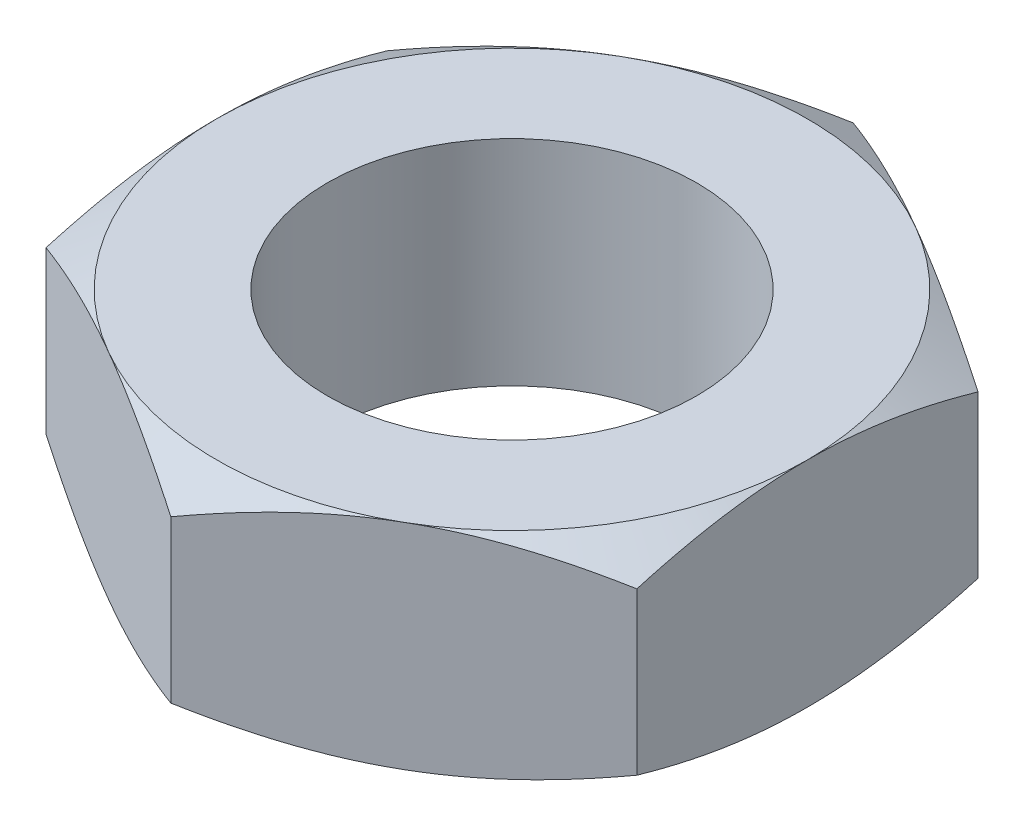
ISO-10303-21;
HEADER;
FILE_DESCRIPTION(('STEP AP214'),'2;1');
FILE_NAME('part.step','',(''),(''),'','','');
FILE_SCHEMA(('AUTOMOTIVE_DESIGN { 1 0 10303 214 1 1 1 1 }'));
ENDSEC;
DATA;
#1=APPLICATION_CONTEXT('core data for automotive mechanical design processes');
#2=APPLICATION_PROTOCOL_DEFINITION('international standard','automotive_design',2000,#1);
#3=PRODUCT_CONTEXT('',#1,'mechanical');
#4=PRODUCT('Part','Part','',(#3));
#5=PRODUCT_RELATED_PRODUCT_CATEGORY('part','',(#4));
#6=PRODUCT_DEFINITION_FORMATION('','',#4);
#7=PRODUCT_DEFINITION_CONTEXT('part definition',#1,'design');
#8=PRODUCT_DEFINITION('design','',#6,#7);
#9=PRODUCT_DEFINITION_SHAPE('','',#8);
#10=(LENGTH_UNIT() NAMED_UNIT(*) SI_UNIT(.MILLI.,.METRE.));
#11=(NAMED_UNIT(*) PLANE_ANGLE_UNIT() SI_UNIT($,.RADIAN.));
#12=(NAMED_UNIT(*) SI_UNIT($,.STERADIAN.) SOLID_ANGLE_UNIT());
#13=UNCERTAINTY_MEASURE_WITH_UNIT(LENGTH_MEASURE(1.E-05),#10,'distance_accuracy_value','');
#14=(GEOMETRIC_REPRESENTATION_CONTEXT(3) GLOBAL_UNCERTAINTY_ASSIGNED_CONTEXT((#13)) GLOBAL_UNIT_ASSIGNED_CONTEXT((#10,
#11,#12)) REPRESENTATION_CONTEXT('',''));
#15=CARTESIAN_POINT('',(0.,0.,0.));
#16=DIRECTION('',(0.,0.,1.));
#17=DIRECTION('',(1.,0.,0.));
#18=AXIS2_PLACEMENT_3D('',#15,#16,#17);
#19=CARTESIAN_POINT('',(-4.,1.45,-2.30940107675852));
#20=DIRECTION('',(0.,1.,0.));
#21=DIRECTION('',(0.,0.,1.));
#22=AXIS2_PLACEMENT_3D('',#19,#20,#21);
#23=PLANE('',#22);
#24=CARTESIAN_POINT('',(0.,1.45,0.));
#25=DIRECTION('',(0.,1.,0.));
#26=DIRECTION('',(0.,0.,1.));
#27=AXIS2_PLACEMENT_3D('',#24,#25,#26);
#28=CIRCLE('',#27,2.5);
#29=CARTESIAN_POINT('',(0.,1.45,2.5));
#30=VERTEX_POINT('',#29);
#31=EDGE_CURVE('E259',#30,#30,#28,.T.);
#32=ORIENTED_EDGE('',*,*,#31,.F.);
#33=EDGE_LOOP('',(#32));
#34=FACE_BOUND('',#33,.T.);
#35=CARTESIAN_POINT('',(0.,1.45,0.));
#36=DIRECTION('',(0.,1.,0.));
#37=DIRECTION('',(0.,0.,1.));
#38=AXIS2_PLACEMENT_3D('',#35,#36,#37);
#39=CIRCLE('',#38,4.);
#40=CARTESIAN_POINT('',(-1.99999999999999,1.45,3.46410161513774));
#41=VERTEX_POINT('',#40);
#42=CARTESIAN_POINT('',(1.99999999999999,1.45,3.46410161513774));
#43=VERTEX_POINT('',#42);
#44=EDGE_CURVE('E328',#41,#43,#39,.T.);
#45=ORIENTED_EDGE('',*,*,#44,.T.);
#46=CARTESIAN_POINT('',(4.,1.45,0.));
#47=VERTEX_POINT('',#46);
#48=EDGE_CURVE('E332',#43,#47,#39,.T.);
#49=ORIENTED_EDGE('',*,*,#48,.T.);
#50=CARTESIAN_POINT('',(2.00000000000001,1.45,-3.46410161513777));
#51=VERTEX_POINT('',#50);
#52=EDGE_CURVE('E341',#47,#51,#39,.T.);
#53=ORIENTED_EDGE('',*,*,#52,.T.);
#54=CARTESIAN_POINT('',(-2.00000000000001,1.45,-3.46410161513777));
#55=VERTEX_POINT('',#54);
#56=EDGE_CURVE('E347',#51,#55,#39,.T.);
#57=ORIENTED_EDGE('',*,*,#56,.T.);
#58=CARTESIAN_POINT('',(-4.,1.45,0.));
#59=VERTEX_POINT('',#58);
#60=EDGE_CURVE('E337',#55,#59,#39,.T.);
#61=ORIENTED_EDGE('',*,*,#60,.T.);
#62=EDGE_CURVE('E331',#59,#41,#39,.T.);
#63=ORIENTED_EDGE('',*,*,#62,.T.);
#64=EDGE_LOOP('',(#45,#49,#53,#57,#61,#63));
#65=FACE_BOUND('',#64,.T.);
#66=ADVANCED_FACE('F41',(#34,#65),#23,.T.);
#67=CARTESIAN_POINT('',(0.,1.45,-4.61880215351703));
#68=DIRECTION('',(0.5,0.,0.866025403784438));
#69=DIRECTION('',(0.866025403784438,0.,-0.5));
#70=AXIS2_PLACEMENT_3D('',#67,#68,#69);
#71=PLANE('',#70);
#72=DIRECTION('',(0.,-1.,0.));
#73=VECTOR('',#72,1.);
#74=CARTESIAN_POINT('',(0.,1.45,-4.61880215351703));
#75=LINE('',#74,#73);
#76=CARTESIAN_POINT('',(0.,1.09273441009183,-4.61880215351703));
#77=VERTEX_POINT('',#76);
#78=CARTESIAN_POINT('',(0.,-1.09273441009183,-4.61880215351703));
#79=VERTEX_POINT('',#78);
#80=EDGE_CURVE('E255',#77,#79,#75,.T.);
#81=ORIENTED_EDGE('',*,*,#80,.T.);
#82=CARTESIAN_POINT('',(0.000200000000003521,-1.09266774092522,-4.61891762357087));
#83=CARTESIAN_POINT('',(-0.175579150323225,-1.15128212635171,-4.51743148381383));
#84=CARTESIAN_POINT('',(-0.352875616326379,-1.20458967853773,-4.41506932144054));
#85=CARTESIAN_POINT('',(-0.710538593175707,-1.29763832925359,-4.20857250547742));
#86=CARTESIAN_POINT('',(-0.890911458970152,-1.33734651097029,-4.10443418285649));
#87=CARTESIAN_POINT('',(-1.24942181870279,-1.39915778471971,-3.89744813015758));
#88=CARTESIAN_POINT('',(-1.42750415293515,-1.4216722684771,-3.79463224655061));
#89=CARTESIAN_POINT('',(-1.78450671716651,-1.44854937685341,-3.58851671999025));
#90=CARTESIAN_POINT('',(-1.96342564964411,-1.45293425857305,-3.48521782616119));
#91=CARTESIAN_POINT('',(-2.29774284219674,-1.44380992706002,-3.2921997050462));
#92=CARTESIAN_POINT('',(-2.45319115998707,-1.432541046012,-3.20245157692488));
#93=CARTESIAN_POINT('',(-2.76307505563506,-1.3968260092018,-3.02354002635498));
#94=CARTESIAN_POINT('',(-2.91750956174414,-1.37236765428846,-2.93437722268074));
#95=CARTESIAN_POINT('',(-3.22803232777458,-1.3112239350807,-2.75509682012356));
#96=CARTESIAN_POINT('',(-3.38408128806311,-1.27427939634513,-2.66500191089422));
#97=CARTESIAN_POINT('',(-3.69385183540384,-1.19042992745197,-2.48615580200002));
#98=CARTESIAN_POINT('',(-3.84757739077378,-1.14354469778725,-2.39740231122586));
#99=CARTESIAN_POINT('',(-4.0002,-1.09266774092523,-2.30928560670468));
#100=B_SPLINE_CURVE_WITH_KNOTS('',3,(#82,#83,#84,#85,#86,#87,#88,#89,#90,#91,#92,#93,#94,#95,
#96,#97,#98,#99),.UNSPECIFIED.,.F.,.F.,(4,2,2,2,2,2,2,2,4),(0.,0.634047835695969,
1.26961969224544,1.88946157213123,2.50854226669298,3.04757825393387,3.58711366126904,
4.13861653143765,4.68903648037744),.UNSPECIFIED.);
#101=CARTESIAN_POINT('',(-2.,-1.45,-3.46410161513776));
#102=VERTEX_POINT('',#101);
#103=EDGE_CURVE('E65',#79,#102,#100,.T.);
#104=ORIENTED_EDGE('',*,*,#103,.T.);
#105=CARTESIAN_POINT('',(-4.,-1.092734410092,-2.30940107675877));
#106=VERTEX_POINT('',#105);
#107=EDGE_CURVE('E206',#102,#106,#100,.T.);
#108=ORIENTED_EDGE('',*,*,#107,.T.);
#109=DIRECTION('',(0.,-1.,0.));
#110=VECTOR('',#109,1.);
#111=CARTESIAN_POINT('',(-4.,1.45,-2.30940107675852));
#112=LINE('',#111,#110);
#113=CARTESIAN_POINT('',(-4.,1.092734410092,-2.30940107675877));
#114=VERTEX_POINT('',#113);
#115=EDGE_CURVE('E238',#114,#106,#112,.T.);
#116=ORIENTED_EDGE('',*,*,#115,.F.);
#117=CARTESIAN_POINT('',(0.000200000000003521,1.09266774092522,-4.61891762357087));
#118=CARTESIAN_POINT('',(-0.175579150323225,1.15128212635171,-4.51743148381383));
#119=CARTESIAN_POINT('',(-0.352875616326379,1.20458967853773,-4.41506932144054));
#120=CARTESIAN_POINT('',(-0.710538593175707,1.29763832925359,-4.20857250547742));
#121=CARTESIAN_POINT('',(-0.890911458970152,1.33734651097029,-4.10443418285649));
#122=CARTESIAN_POINT('',(-1.24942181870279,1.39915778471971,-3.89744813015758));
#123=CARTESIAN_POINT('',(-1.42750415293515,1.4216722684771,-3.79463224655061));
#124=CARTESIAN_POINT('',(-1.78450671716651,1.44854937685341,-3.58851671999025));
#125=CARTESIAN_POINT('',(-1.96342564964411,1.45293425857305,-3.48521782616119));
#126=CARTESIAN_POINT('',(-2.29774284219674,1.44380992706002,-3.2921997050462));
#127=CARTESIAN_POINT('',(-2.45319115998707,1.432541046012,-3.20245157692488));
#128=CARTESIAN_POINT('',(-2.76307505563506,1.3968260092018,-3.02354002635498));
#129=CARTESIAN_POINT('',(-2.91750956174414,1.37236765428846,-2.93437722268074));
#130=CARTESIAN_POINT('',(-3.22803232777458,1.3112239350807,-2.75509682012356));
#131=CARTESIAN_POINT('',(-3.38408128806311,1.27427939634513,-2.66500191089422));
#132=CARTESIAN_POINT('',(-3.69385183540384,1.19042992745197,-2.48615580200002));
#133=CARTESIAN_POINT('',(-3.84757739077378,1.14354469778725,-2.39740231122586));
#134=CARTESIAN_POINT('',(-4.0002,1.09266774092523,-2.30928560670468));
#135=B_SPLINE_CURVE_WITH_KNOTS('',3,(#117,#118,#119,#120,#121,#122,#123,#124,#125,#126,#127,
#128,#129,#130,#131,#132,#133,#134),.UNSPECIFIED.,.F.,.F.,(4,2,2,2,2,2,2,2,4),(0.,
0.634047835695969,1.26961969224544,1.88946157213123,2.50854226669298,3.04757825393387,
3.58711366126904,4.13861653143765,4.68903648037744),.UNSPECIFIED.);
#136=EDGE_CURVE('E268',#55,#114,#135,.T.);
#137=ORIENTED_EDGE('',*,*,#136,.F.);
#138=EDGE_CURVE('E264',#77,#55,#135,.T.);
#139=ORIENTED_EDGE('',*,*,#138,.F.);
#140=EDGE_LOOP('',(#81,#104,#108,#116,#137,#139));
#141=FACE_BOUND('',#140,.T.);
#142=ADVANCED_FACE('F43',(#141),#71,.F.);
#143=CARTESIAN_POINT('',(-4.,1.45,-2.30940107675852));
#144=DIRECTION('',(1.,0.,0.));
#145=DIRECTION('',(0.,0.,-1.));
#146=AXIS2_PLACEMENT_3D('',#143,#144,#145);
#147=PLANE('',#146);
#148=ORIENTED_EDGE('',*,*,#115,.T.);
#149=CARTESIAN_POINT('',(-4.,0.538272613304659,-6.27773824229584));
#150=CARTESIAN_POINT('',(-4.,0.452907434019681,-6.10237135338491));
#151=CARTESIAN_POINT('',(-4.,0.368339606228033,-5.92660975547416));
#152=CARTESIAN_POINT('',(-4.,0.201245732371285,-5.57408747219406));
#153=CARTESIAN_POINT('',(-4.,0.118719994253595,-5.39732664101815));
#154=CARTESIAN_POINT('',(-4.,-0.0442418975962508,-5.04172096279603));
#155=CARTESIAN_POINT('',(-4.,-0.124664861512767,-4.86287005095233));
#156=CARTESIAN_POINT('',(-4.,-0.282316868417397,-4.50377124741416));
#157=CARTESIAN_POINT('',(-4.,-0.359546057582969,-4.32352342010519));
#158=CARTESIAN_POINT('',(-4.,-0.512482417261019,-3.95529409103604));
#159=CARTESIAN_POINT('',(-4.,-0.588052572540733,-3.76725537858836));
#160=CARTESIAN_POINT('',(-4.,-0.733651507189509,-3.38900576888467));
#161=CARTESIAN_POINT('',(-4.,-0.803679675396341,-3.19879463469657));
#162=CARTESIAN_POINT('',(-4.,-0.936410948887337,-2.81622996195037));
#163=CARTESIAN_POINT('',(-4.,-0.9991282496714,-2.62388139726236));
#164=CARTESIAN_POINT('',(-4.,-1.11527480466877,-2.23642609111652));
#165=CARTESIAN_POINT('',(-4.,-1.16870690568488,-2.04132021494676));
#166=CARTESIAN_POINT('',(-4.,-1.26348621325749,-1.64931331843411));
#167=CARTESIAN_POINT('',(-4.,-1.30490020887598,-1.45242874393374));
#168=CARTESIAN_POINT('',(-4.,-1.37334779080902,-1.05613530348651));
#169=CARTESIAN_POINT('',(-4.,-1.40038290951243,-0.856726708849978));
#170=CARTESIAN_POINT('',(-4.,-1.43756563434954,-0.459016419046131));
#171=CARTESIAN_POINT('',(-4.,-1.44793619394465,-0.260736096275138));
#172=CARTESIAN_POINT('',(-4.,-1.45150239474572,0.135999449725752));
#173=CARTESIAN_POINT('',(-4.,-1.44469773823018,0.334454675927879));
#174=CARTESIAN_POINT('',(-4.,-1.41922588457332,0.66915891902629));
#175=CARTESIAN_POINT('',(-4.,-1.40485378700603,0.805756439229811));
#176=CARTESIAN_POINT('',(-4.,-1.36882749387531,1.07799415072018));
#177=CARTESIAN_POINT('',(-4.,-1.34717237275487,1.2136342180919));
#178=CARTESIAN_POINT('',(-4.,-1.27241631307078,1.61891000057833));
#179=CARTESIAN_POINT('',(-4.,-1.20953652172373,1.88676436735881));
#180=CARTESIAN_POINT('',(-4.,-1.09993846376045,2.28746873197677));
#181=CARTESIAN_POINT('',(-4.,-1.06031988459696,2.42237920261849));
#182=CARTESIAN_POINT('',(-4.,-0.976830211268155,2.69089057744235));
#183=CARTESIAN_POINT('',(-4.,-0.932959084961521,2.82449147171815));
#184=CARTESIAN_POINT('',(-4.,-0.841679797120904,3.09042485389889));
#185=CARTESIAN_POINT('',(-4.,-0.794272666033039,3.22275769874561));
#186=CARTESIAN_POINT('',(-4.,-0.696492903270062,3.48631639413451));
#187=CARTESIAN_POINT('',(-4.,-0.646120335411573,3.61754226842943));
#188=CARTESIAN_POINT('',(-4.,-0.508529812999668,3.96608368322672));
#189=CARTESIAN_POINT('',(-4.,-0.419115122968092,4.18253115381255));
#190=CARTESIAN_POINT('',(-4.,-0.235150168269624,4.61324050047419));
#191=CARTESIAN_POINT('',(-4.,-0.140599367587236,4.82750214565029));
#192=CARTESIAN_POINT('',(-4.,0.0524372834170321,5.25432484735959));
#193=CARTESIAN_POINT('',(-4.,0.150924422927724,5.46688531892831));
#194=CARTESIAN_POINT('',(-4.,0.350916180460176,5.89058494083092));
#195=CARTESIAN_POINT('',(-4.,0.45242088765084,6.10172404893707));
#196=CARTESIAN_POINT('',(-4.,0.657948937835168,6.52316514486136));
#197=CARTESIAN_POINT('',(-4.,0.76197585190723,6.73346538762343));
#198=CARTESIAN_POINT('',(-4.,0.971920361321712,7.15312098906691));
#199=CARTESIAN_POINT('',(-4.,1.07783797638236,7.36247633786542));
#200=CARTESIAN_POINT('',(-4.,1.39781092006675,7.98929601970436));
#201=CARTESIAN_POINT('',(-4.,1.61413064240649,8.4056039494251));
#202=CARTESIAN_POINT('',(-4.,2.02823155260579,9.19312143275001));
#203=CARTESIAN_POINT('',(-4.,2.22561539495853,9.5645409319032));
#204=CARTESIAN_POINT('',(-4.,2.62278601618717,10.3061201550337));
#205=CARTESIAN_POINT('',(-4.,2.82257293478048,10.6762798041409));
#206=CARTESIAN_POINT('',(-4.,3.2232770352111,11.4144277808665));
#207=CARTESIAN_POINT('',(-4.,3.42418842969087,11.7824192551049));
#208=CARTESIAN_POINT('',(-4.,3.82738131549969,12.517614862887));
#209=CARTESIAN_POINT('',(-4.,4.02966270174891,12.8848190540346));
#210=CARTESIAN_POINT('',(-4.,4.23244381411323,13.2517453295503));
#211=B_SPLINE_CURVE_WITH_KNOTS('',3,(#149,#150,#151,#152,#153,#154,#155,#156,#157,#158,#159,
#160,#161,#162,#163,#164,#165,#166,#167,#168,#169,#170,#171,#172,#173,#174,#175,#176,#177,#178,
#179,#180,#181,#182,#183,#184,#185,#186,#187,#188,#189,#190,#191,#192,#193,#194,#195,#196,#197,
#198,#199,#200,#201,#202,#203,#204,#205,#206,#207,#208,#209,#210),.UNSPECIFIED.,.F.,.F.,(4,2,2,
2,2,2,2,2,2,2,2,2,2,2,2,2,2,2,2,2,2,2,2,2,2,2,2,2,2,2,4),(0.,0.585128016457923,1.17034373910183,
1.75862092696578,2.34687115981268,2.95477124097556,3.56273826732422,4.16950441610763,
4.77608420348307,5.37922545001348,5.98230240555508,6.57724158478653,7.17219107698255,
7.58404733706222,7.99595595734373,8.82018363496752,9.24196829808151,9.66375614934919,
10.0854215618084,10.5070779032824,11.2095467374429,11.9120890241286,12.614863316489,
13.3176583964612,14.021514499781,14.725377947948,16.1328040521549,17.3946252523616,
18.6565201742662,19.9143119882681,21.1720083968738),.UNSPECIFIED.);
#212=CARTESIAN_POINT('',(-4.,-1.45,0.));
#213=VERTEX_POINT('',#212);
#214=EDGE_CURVE('E304',#106,#213,#211,.T.);
#215=ORIENTED_EDGE('',*,*,#214,.T.);
#216=CARTESIAN_POINT('',(-4.,-1.09273441009184,2.30940107675848));
#217=VERTEX_POINT('',#216);
#218=EDGE_CURVE('E297',#213,#217,#211,.T.);
#219=ORIENTED_EDGE('',*,*,#218,.T.);
#220=DIRECTION('',(0.,-1.,0.));
#221=VECTOR('',#220,1.);
#222=CARTESIAN_POINT('',(-4.,1.45,2.30940107675848));
#223=LINE('',#222,#221);
#224=CARTESIAN_POINT('',(-4.,1.09273441009184,2.30940107675848));
#225=VERTEX_POINT('',#224);
#226=EDGE_CURVE('E242',#225,#217,#223,.T.);
#227=ORIENTED_EDGE('',*,*,#226,.F.);
#228=CARTESIAN_POINT('',(-4.,-0.538272613304659,-6.27773824229584));
#229=CARTESIAN_POINT('',(-4.,-0.452907434019681,-6.10237135338491));
#230=CARTESIAN_POINT('',(-4.,-0.368339606228033,-5.92660975547416));
#231=CARTESIAN_POINT('',(-4.,-0.201245732371285,-5.57408747219406));
#232=CARTESIAN_POINT('',(-4.,-0.118719994253595,-5.39732664101815));
#233=CARTESIAN_POINT('',(-4.,0.0442418975962508,-5.04172096279603));
#234=CARTESIAN_POINT('',(-4.,0.124664861512767,-4.86287005095233));
#235=CARTESIAN_POINT('',(-4.,0.282316868417397,-4.50377124741416));
#236=CARTESIAN_POINT('',(-4.,0.359546057582969,-4.32352342010519));
#237=CARTESIAN_POINT('',(-4.,0.512482417261019,-3.95529409103604));
#238=CARTESIAN_POINT('',(-4.,0.588052572540733,-3.76725537858836));
#239=CARTESIAN_POINT('',(-4.,0.733651507189509,-3.38900576888467));
#240=CARTESIAN_POINT('',(-4.,0.803679675396341,-3.19879463469657));
#241=CARTESIAN_POINT('',(-4.,0.936410948887337,-2.81622996195037));
#242=CARTESIAN_POINT('',(-4.,0.9991282496714,-2.62388139726236));
#243=CARTESIAN_POINT('',(-4.,1.11527480466877,-2.23642609111652));
#244=CARTESIAN_POINT('',(-4.,1.16870690568488,-2.04132021494676));
#245=CARTESIAN_POINT('',(-4.,1.26348621325749,-1.64931331843411));
#246=CARTESIAN_POINT('',(-4.,1.30490020887598,-1.45242874393374));
#247=CARTESIAN_POINT('',(-4.,1.37334779080902,-1.05613530348651));
#248=CARTESIAN_POINT('',(-4.,1.40038290951243,-0.856726708849978));
#249=CARTESIAN_POINT('',(-4.,1.43756563434954,-0.459016419046131));
#250=CARTESIAN_POINT('',(-4.,1.44793619394465,-0.260736096275138));
#251=CARTESIAN_POINT('',(-4.,1.45150239474572,0.135999449725752));
#252=CARTESIAN_POINT('',(-4.,1.44469773823018,0.334454675927879));
#253=CARTESIAN_POINT('',(-4.,1.41922588457332,0.66915891902629));
#254=CARTESIAN_POINT('',(-4.,1.40485378700603,0.805756439229811));
#255=CARTESIAN_POINT('',(-4.,1.36882749387531,1.07799415072018));
#256=CARTESIAN_POINT('',(-4.,1.34717237275487,1.2136342180919));
#257=CARTESIAN_POINT('',(-4.,1.27241631307078,1.61891000057833));
#258=CARTESIAN_POINT('',(-4.,1.20953652172373,1.88676436735881));
#259=CARTESIAN_POINT('',(-4.,1.09993846376045,2.28746873197677));
#260=CARTESIAN_POINT('',(-4.,1.06031988459696,2.42237920261849));
#261=CARTESIAN_POINT('',(-4.,0.976830211268155,2.69089057744235));
#262=CARTESIAN_POINT('',(-4.,0.932959084961521,2.82449147171815));
#263=CARTESIAN_POINT('',(-4.,0.841679797120904,3.09042485389889));
#264=CARTESIAN_POINT('',(-4.,0.794272666033039,3.22275769874561));
#265=CARTESIAN_POINT('',(-4.,0.696492903270062,3.48631639413451));
#266=CARTESIAN_POINT('',(-4.,0.646120335411573,3.61754226842943));
#267=CARTESIAN_POINT('',(-4.,0.508529812999668,3.96608368322672));
#268=CARTESIAN_POINT('',(-4.,0.419115122968092,4.18253115381255));
#269=CARTESIAN_POINT('',(-4.,0.235150168269624,4.61324050047419));
#270=CARTESIAN_POINT('',(-4.,0.140599367587236,4.82750214565029));
#271=CARTESIAN_POINT('',(-4.,-0.0524372834170321,5.25432484735959));
#272=CARTESIAN_POINT('',(-4.,-0.150924422927724,5.46688531892831));
#273=CARTESIAN_POINT('',(-4.,-0.350916180460176,5.89058494083092));
#274=CARTESIAN_POINT('',(-4.,-0.45242088765084,6.10172404893707));
#275=CARTESIAN_POINT('',(-4.,-0.657948937835168,6.52316514486136));
#276=CARTESIAN_POINT('',(-4.,-0.76197585190723,6.73346538762343));
#277=CARTESIAN_POINT('',(-4.,-0.971920361321712,7.15312098906691));
#278=CARTESIAN_POINT('',(-4.,-1.07783797638236,7.36247633786542));
#279=CARTESIAN_POINT('',(-4.,-1.39781092006675,7.98929601970436));
#280=CARTESIAN_POINT('',(-4.,-1.61413064240649,8.4056039494251));
#281=CARTESIAN_POINT('',(-4.,-2.02823155260579,9.19312143275001));
#282=CARTESIAN_POINT('',(-4.,-2.22561539495853,9.5645409319032));
#283=CARTESIAN_POINT('',(-4.,-2.62278601618717,10.3061201550337));
#284=CARTESIAN_POINT('',(-4.,-2.82257293478048,10.6762798041409));
#285=CARTESIAN_POINT('',(-4.,-3.2232770352111,11.4144277808665));
#286=CARTESIAN_POINT('',(-4.,-3.42418842969087,11.7824192551049));
#287=CARTESIAN_POINT('',(-4.,-3.82738131549969,12.517614862887));
#288=CARTESIAN_POINT('',(-4.,-4.02966270174891,12.8848190540346));
#289=CARTESIAN_POINT('',(-4.,-4.23244381411323,13.2517453295503));
#290=B_SPLINE_CURVE_WITH_KNOTS('',3,(#228,#229,#230,#231,#232,#233,#234,#235,#236,#237,#238,
#239,#240,#241,#242,#243,#244,#245,#246,#247,#248,#249,#250,#251,#252,#253,#254,#255,#256,#257,
#258,#259,#260,#261,#262,#263,#264,#265,#266,#267,#268,#269,#270,#271,#272,#273,#274,#275,#276,
#277,#278,#279,#280,#281,#282,#283,#284,#285,#286,#287,#288,#289),.UNSPECIFIED.,.F.,.F.,(4,2,2,
2,2,2,2,2,2,2,2,2,2,2,2,2,2,2,2,2,2,2,2,2,2,2,2,2,2,2,4),(0.,0.585128016457923,1.17034373910183,
1.75862092696578,2.34687115981268,2.95477124097556,3.56273826732422,4.16950441610763,
4.77608420348307,5.37922545001348,5.98230240555508,6.57724158478653,7.17219107698255,
7.58404733706222,7.99595595734373,8.82018363496752,9.24196829808151,9.66375614934919,
10.0854215618084,10.5070779032824,11.2095467374429,11.9120890241286,12.614863316489,
13.3176583964612,14.021514499781,14.725377947948,16.1328040521549,17.3946252523616,
18.6565201742662,19.9143119882681,21.1720083968738),.UNSPECIFIED.);
#291=EDGE_CURVE('E276',#59,#225,#290,.T.);
#292=ORIENTED_EDGE('',*,*,#291,.F.);
#293=EDGE_CURVE('E275',#114,#59,#290,.T.);
#294=ORIENTED_EDGE('',*,*,#293,.F.);
#295=EDGE_LOOP('',(#148,#215,#219,#227,#292,#294));
#296=FACE_BOUND('',#295,.T.);
#297=ADVANCED_FACE('F290',(#296),#147,.F.);
#298=CARTESIAN_POINT('',(-4.,1.45,2.30940107675848));
#299=DIRECTION('',(0.5,0.,-0.866025403784439));
#300=DIRECTION('',(-0.866025403784439,0.,-0.5));
#301=AXIS2_PLACEMENT_3D('',#298,#299,#300);
#302=PLANE('',#301);
#303=ORIENTED_EDGE('',*,*,#226,.T.);
#304=CARTESIAN_POINT('',(-4.0002,-1.09266774092524,2.30928560670465));
#305=CARTESIAN_POINT('',(-3.82442084967677,-1.15128212635172,2.41077174646169));
#306=CARTESIAN_POINT('',(-3.64712438367362,-1.20458967853774,2.51313390883498));
#307=CARTESIAN_POINT('',(-3.2894614068243,-1.2976383292536,2.7196307247981));
#308=CARTESIAN_POINT('',(-3.10908854102985,-1.3373465109703,2.82376904741902));
#309=CARTESIAN_POINT('',(-2.75057818129721,-1.39915778471973,3.03075510011793));
#310=CARTESIAN_POINT('',(-2.57249584706486,-1.42167226847712,3.1335709837249));
#311=CARTESIAN_POINT('',(-2.2154932828335,-1.44854937685343,3.33968651028526));
#312=CARTESIAN_POINT('',(-2.03657435035591,-1.45293425857307,3.44298540411432));
#313=CARTESIAN_POINT('',(-1.70225715780327,-1.44380992706004,3.6360035252293));
#314=CARTESIAN_POINT('',(-1.54680884001294,-1.43254104601202,3.72575165335062));
#315=CARTESIAN_POINT('',(-1.23692494436495,-1.39682600920182,3.90466320392052));
#316=CARTESIAN_POINT('',(-1.08249043825587,-1.37236765428848,3.99382600759476));
#317=CARTESIAN_POINT('',(-0.771967672225426,-1.31122393508072,4.17310641015195));
#318=CARTESIAN_POINT('',(-0.615918711936902,-1.27427939634515,4.26320131938129));
#319=CARTESIAN_POINT('',(-0.306148164596164,-1.19042992745199,4.44204742827548));
#320=CARTESIAN_POINT('',(-0.152422609226224,-1.14354469778727,4.53080091904964));
#321=CARTESIAN_POINT('',(0.000199999999997188,-1.09266774092525,4.61891762357082));
#322=B_SPLINE_CURVE_WITH_KNOTS('',3,(#304,#305,#306,#307,#308,#309,#310,#311,#312,#313,#314,
#315,#316,#317,#318,#319,#320,#321),.UNSPECIFIED.,.F.,.F.,(4,2,2,2,2,2,2,2,4),(0.,
0.634047835695965,1.26961969224543,1.88946157213122,2.50854226669297,3.04757825393385,
3.58711366126903,4.13861653143764,4.68903648037743),.UNSPECIFIED.);
#323=CARTESIAN_POINT('',(-2.,-1.45,3.46410161513776));
#324=VERTEX_POINT('',#323);
#325=EDGE_CURVE('E171',#217,#324,#322,.T.);
#326=ORIENTED_EDGE('',*,*,#325,.T.);
#327=CARTESIAN_POINT('',(0.,-1.09273441009185,4.61880215351699));
#328=VERTEX_POINT('',#327);
#329=EDGE_CURVE('E151',#324,#328,#322,.T.);
#330=ORIENTED_EDGE('',*,*,#329,.T.);
#331=DIRECTION('',(0.,-1.,0.));
#332=VECTOR('',#331,1.);
#333=CARTESIAN_POINT('',(0.,1.45,4.61880215351699));
#334=LINE('',#333,#332);
#335=CARTESIAN_POINT('',(0.,1.09273441009185,4.61880215351699));
#336=VERTEX_POINT('',#335);
#337=EDGE_CURVE('E168',#336,#328,#334,.T.);
#338=ORIENTED_EDGE('',*,*,#337,.F.);
#339=CARTESIAN_POINT('',(-4.0002,1.09266774092524,2.30928560670465));
#340=CARTESIAN_POINT('',(-3.82442084967677,1.15128212635172,2.41077174646169));
#341=CARTESIAN_POINT('',(-3.64712438367362,1.20458967853774,2.51313390883498));
#342=CARTESIAN_POINT('',(-3.2894614068243,1.2976383292536,2.7196307247981));
#343=CARTESIAN_POINT('',(-3.10908854102985,1.3373465109703,2.82376904741902));
#344=CARTESIAN_POINT('',(-2.75057818129721,1.39915778471973,3.03075510011793));
#345=CARTESIAN_POINT('',(-2.57249584706486,1.42167226847712,3.1335709837249));
#346=CARTESIAN_POINT('',(-2.2154932828335,1.44854937685343,3.33968651028526));
#347=CARTESIAN_POINT('',(-2.03657435035591,1.45293425857307,3.44298540411432));
#348=CARTESIAN_POINT('',(-1.70225715780327,1.44380992706004,3.6360035252293));
#349=CARTESIAN_POINT('',(-1.54680884001294,1.43254104601202,3.72575165335062));
#350=CARTESIAN_POINT('',(-1.23692494436495,1.39682600920182,3.90466320392052));
#351=CARTESIAN_POINT('',(-1.08249043825587,1.37236765428848,3.99382600759476));
#352=CARTESIAN_POINT('',(-0.771967672225426,1.31122393508072,4.17310641015195));
#353=CARTESIAN_POINT('',(-0.615918711936902,1.27427939634515,4.26320131938129));
#354=CARTESIAN_POINT('',(-0.306148164596164,1.19042992745199,4.44204742827548));
#355=CARTESIAN_POINT('',(-0.152422609226224,1.14354469778727,4.53080091904964));
#356=CARTESIAN_POINT('',(0.000199999999997188,1.09266774092525,4.61891762357082));
#357=B_SPLINE_CURVE_WITH_KNOTS('',3,(#339,#340,#341,#342,#343,#344,#345,#346,#347,#348,#349,
#350,#351,#352,#353,#354,#355,#356),.UNSPECIFIED.,.F.,.F.,(4,2,2,2,2,2,2,2,4),(0.,
0.634047835695965,1.26961969224543,1.88946157213122,2.50854226669297,3.04757825393385,
3.58711366126903,4.13861653143764,4.68903648037743),.UNSPECIFIED.);
#358=EDGE_CURVE('E284',#41,#336,#357,.T.);
#359=ORIENTED_EDGE('',*,*,#358,.F.);
#360=EDGE_CURVE('E283',#225,#41,#357,.T.);
#361=ORIENTED_EDGE('',*,*,#360,.F.);
#362=EDGE_LOOP('',(#303,#326,#330,#338,#359,#361));
#363=FACE_BOUND('',#362,.T.);
#364=ADVANCED_FACE('F293',(#363),#302,.F.);
#365=CARTESIAN_POINT('',(0.,1.45,4.61880215351699));
#366=DIRECTION('',(-0.5,0.,-0.866025403784439));
#367=DIRECTION('',(-0.866025403784439,0.,0.5));
#368=AXIS2_PLACEMENT_3D('',#365,#366,#367);
#369=PLANE('',#368);
#370=ORIENTED_EDGE('',*,*,#337,.T.);
#371=CARTESIAN_POINT('',(-0.00020000000000273,-1.09266774092525,4.61891762357082));
#372=CARTESIAN_POINT('',(0.175579150323224,-1.15128212635173,4.51743148381379));
#373=CARTESIAN_POINT('',(0.352875616326376,-1.20458967853775,4.4150693214405));
#374=CARTESIAN_POINT('',(0.7105385931757,-1.29763832925361,4.20857250547738));
#375=CARTESIAN_POINT('',(0.890911458970144,-1.33734651097031,4.10443418285645));
#376=CARTESIAN_POINT('',(1.24942181870278,-1.39915778471973,3.89744813015754));
#377=CARTESIAN_POINT('',(1.42750415293513,-1.42167226847712,3.79463224655058));
#378=CARTESIAN_POINT('',(1.7845067171665,-1.44854937685343,3.58851671999021));
#379=CARTESIAN_POINT('',(1.96342564964409,-1.45293425857307,3.48521782616115));
#380=CARTESIAN_POINT('',(2.29774284219672,-1.44380992706004,3.29219970504617));
#381=CARTESIAN_POINT('',(2.45319115998706,-1.43254104601202,3.20245157692485));
#382=CARTESIAN_POINT('',(2.76307505563505,-1.39682600920182,3.02354002635495));
#383=CARTESIAN_POINT('',(2.91750956174412,-1.37236765428848,2.93437722268071));
#384=CARTESIAN_POINT('',(3.22803232777457,-1.31122393508072,2.75509682012352));
#385=CARTESIAN_POINT('',(3.3840812880631,-1.27427939634515,2.66500191089418));
#386=CARTESIAN_POINT('',(3.69385183540384,-1.19042992745198,2.48615580199999));
#387=CARTESIAN_POINT('',(3.84757739077378,-1.14354469778727,2.39740231122583));
#388=CARTESIAN_POINT('',(4.0002,-1.09266774092524,2.30928560670464));
#389=B_SPLINE_CURVE_WITH_KNOTS('',3,(#371,#372,#373,#374,#375,#376,#377,#378,#379,#380,#381,
#382,#383,#384,#385,#386,#387,#388),.UNSPECIFIED.,.F.,.F.,(4,2,2,2,2,2,2,2,4),(0.,
0.634047835695963,1.26961969224543,1.88946157213121,2.50854226669296,3.04757825393385,
3.58711366126903,4.13861653143764,4.68903648037743),.UNSPECIFIED.);
#390=CARTESIAN_POINT('',(2.,-1.45,3.46410161513776));
#391=VERTEX_POINT('',#390);
#392=EDGE_CURVE('E145',#328,#391,#389,.T.);
#393=ORIENTED_EDGE('',*,*,#392,.T.);
#394=CARTESIAN_POINT('',(4.,-1.09273441009185,2.30940107675848));
#395=VERTEX_POINT('',#394);
#396=EDGE_CURVE('E132',#391,#395,#389,.T.);
#397=ORIENTED_EDGE('',*,*,#396,.T.);
#398=DIRECTION('',(0.,-1.,0.));
#399=VECTOR('',#398,1.);
#400=CARTESIAN_POINT('',(4.,1.45,2.30940107675848));
#401=LINE('',#400,#399);
#402=CARTESIAN_POINT('',(4.,1.09273441009185,2.30940107675848));
#403=VERTEX_POINT('',#402);
#404=EDGE_CURVE('E248',#403,#395,#401,.T.);
#405=ORIENTED_EDGE('',*,*,#404,.F.);
#406=CARTESIAN_POINT('',(-0.00020000000000273,1.09266774092525,4.61891762357082));
#407=CARTESIAN_POINT('',(0.175579150323224,1.15128212635173,4.51743148381379));
#408=CARTESIAN_POINT('',(0.352875616326376,1.20458967853775,4.4150693214405));
#409=CARTESIAN_POINT('',(0.7105385931757,1.29763832925361,4.20857250547738));
#410=CARTESIAN_POINT('',(0.890911458970144,1.33734651097031,4.10443418285645));
#411=CARTESIAN_POINT('',(1.24942181870278,1.39915778471973,3.89744813015754));
#412=CARTESIAN_POINT('',(1.42750415293513,1.42167226847712,3.79463224655058));
#413=CARTESIAN_POINT('',(1.7845067171665,1.44854937685343,3.58851671999021));
#414=CARTESIAN_POINT('',(1.96342564964409,1.45293425857307,3.48521782616115));
#415=CARTESIAN_POINT('',(2.29774284219672,1.44380992706004,3.29219970504617));
#416=CARTESIAN_POINT('',(2.45319115998706,1.43254104601202,3.20245157692485));
#417=CARTESIAN_POINT('',(2.76307505563505,1.39682600920182,3.02354002635495));
#418=CARTESIAN_POINT('',(2.91750956174412,1.37236765428848,2.93437722268071));
#419=CARTESIAN_POINT('',(3.22803232777457,1.31122393508072,2.75509682012352));
#420=CARTESIAN_POINT('',(3.3840812880631,1.27427939634515,2.66500191089418));
#421=CARTESIAN_POINT('',(3.69385183540384,1.19042992745198,2.48615580199999));
#422=CARTESIAN_POINT('',(3.84757739077378,1.14354469778727,2.39740231122583));
#423=CARTESIAN_POINT('',(4.0002,1.09266774092524,2.30928560670464));
#424=B_SPLINE_CURVE_WITH_KNOTS('',3,(#406,#407,#408,#409,#410,#411,#412,#413,#414,#415,#416,
#417,#418,#419,#420,#421,#422,#423),.UNSPECIFIED.,.F.,.F.,(4,2,2,2,2,2,2,2,4),(0.,
0.634047835695963,1.26961969224543,1.88946157213121,2.50854226669296,3.04757825393385,
3.58711366126903,4.13861653143764,4.68903648037743),.UNSPECIFIED.);
#425=EDGE_CURVE('E367',#43,#403,#424,.T.);
#426=ORIENTED_EDGE('',*,*,#425,.F.);
#427=EDGE_CURVE('E364',#336,#43,#424,.T.);
#428=ORIENTED_EDGE('',*,*,#427,.F.);
#429=EDGE_LOOP('',(#370,#393,#397,#405,#426,#428));
#430=FACE_BOUND('',#429,.T.);
#431=ADVANCED_FACE('F165',(#430),#369,.F.);
#432=CARTESIAN_POINT('',(4.,1.45,2.30940107675848));
#433=DIRECTION('',(-1.,0.,0.));
#434=DIRECTION('',(0.,0.,1.));
#435=AXIS2_PLACEMENT_3D('',#432,#433,#434);
#436=PLANE('',#435);
#437=ORIENTED_EDGE('',*,*,#404,.T.);
#438=CARTESIAN_POINT('',(3.99999999999999,0.538272613304659,-6.27773824229584));
#439=CARTESIAN_POINT('',(4.,0.452907434019681,-6.10237135338491));
#440=CARTESIAN_POINT('',(4.,0.368339606228033,-5.92660975547416));
#441=CARTESIAN_POINT('',(4.,0.201245732371284,-5.57408747219407));
#442=CARTESIAN_POINT('',(4.,0.118719994253595,-5.39732664101816));
#443=CARTESIAN_POINT('',(4.,-0.0442418975962508,-5.04172096279604));
#444=CARTESIAN_POINT('',(4.,-0.124664861512767,-4.86287005095233));
#445=CARTESIAN_POINT('',(4.,-0.282316868417397,-4.50377124741417));
#446=CARTESIAN_POINT('',(4.,-0.359546057582969,-4.32352342010519));
#447=CARTESIAN_POINT('',(4.,-0.512482417261019,-3.95529409103604));
#448=CARTESIAN_POINT('',(4.,-0.588052572540733,-3.76725537858837));
#449=CARTESIAN_POINT('',(4.,-0.73365150718951,-3.38900576888467));
#450=CARTESIAN_POINT('',(4.,-0.803679675396341,-3.19879463469658));
#451=CARTESIAN_POINT('',(4.,-0.936410948887338,-2.81622996195037));
#452=CARTESIAN_POINT('',(4.,-0.999128249671401,-2.62388139726237));
#453=CARTESIAN_POINT('',(4.,-1.11527480466877,-2.23642609111653));
#454=CARTESIAN_POINT('',(4.,-1.16870690568488,-2.04132021494677));
#455=CARTESIAN_POINT('',(4.,-1.26348621325749,-1.64931331843412));
#456=CARTESIAN_POINT('',(4.,-1.30490020887598,-1.45242874393374));
#457=CARTESIAN_POINT('',(4.,-1.37334779080902,-1.05613530348652));
#458=CARTESIAN_POINT('',(4.,-1.40038290951244,-0.856726708849986));
#459=CARTESIAN_POINT('',(4.,-1.43756563434955,-0.459016419046139));
#460=CARTESIAN_POINT('',(4.,-1.44793619394466,-0.260736096275146));
#461=CARTESIAN_POINT('',(4.,-1.45150239474572,0.135999449725744));
#462=CARTESIAN_POINT('',(4.,-1.44469773823019,0.33445467592787));
#463=CARTESIAN_POINT('',(4.,-1.41922588457332,0.669158919026282));
#464=CARTESIAN_POINT('',(4.,-1.40485378700603,0.805756439229803));
#465=CARTESIAN_POINT('',(4.,-1.36882749387532,1.07799415072017));
#466=CARTESIAN_POINT('',(4.,-1.34717237275487,1.21363421809189));
#467=CARTESIAN_POINT('',(4.,-1.27241631307078,1.61891000057832));
#468=CARTESIAN_POINT('',(4.,-1.20953652172373,1.8867643673588));
#469=CARTESIAN_POINT('',(4.,-1.09993846376045,2.28746873197676));
#470=CARTESIAN_POINT('',(4.,-1.06031988459696,2.42237920261848));
#471=CARTESIAN_POINT('',(4.,-0.976830211268161,2.69089057744234));
#472=CARTESIAN_POINT('',(4.,-0.932959084961528,2.82449147171813));
#473=CARTESIAN_POINT('',(4.,-0.841679797120911,3.09042485389888));
#474=CARTESIAN_POINT('',(4.,-0.794272666033046,3.2227576987456));
#475=CARTESIAN_POINT('',(4.,-0.69649290327007,3.4863163941345));
#476=CARTESIAN_POINT('',(4.,-0.646120335411581,3.61754226842941));
#477=CARTESIAN_POINT('',(4.,-0.508529812999675,3.9660836832267));
#478=CARTESIAN_POINT('',(4.,-0.4191151229681,4.18253115381253));
#479=CARTESIAN_POINT('',(4.,-0.235150168269631,4.61324050047417));
#480=CARTESIAN_POINT('',(4.,-0.140599367587244,4.82750214565027));
#481=CARTESIAN_POINT('',(4.,0.0524372834170248,5.25432484735958));
#482=CARTESIAN_POINT('',(4.,0.150924422927717,5.4668853189283));
#483=CARTESIAN_POINT('',(4.,0.350916180460169,5.89058494083091));
#484=CARTESIAN_POINT('',(4.,0.452420887650833,6.10172404893706));
#485=CARTESIAN_POINT('',(4.,0.65794893783516,6.52316514486135));
#486=CARTESIAN_POINT('',(4.,0.761975851907223,6.73346538762341));
#487=CARTESIAN_POINT('',(4.,0.971920361321705,7.1531209890669));
#488=CARTESIAN_POINT('',(4.,1.07783797638235,7.36247633786541));
#489=CARTESIAN_POINT('',(4.,1.39781092006674,7.98929601970435));
#490=CARTESIAN_POINT('',(4.,1.61413064240648,8.40560394942509));
#491=CARTESIAN_POINT('',(4.,2.02823155260578,9.19312143275));
#492=CARTESIAN_POINT('',(4.,2.22561539495853,9.56454093190319));
#493=CARTESIAN_POINT('',(4.,2.62278601618717,10.3061201550337));
#494=CARTESIAN_POINT('',(4.,2.82257293478047,10.6762798041409));
#495=CARTESIAN_POINT('',(4.,3.22327703521109,11.4144277808665));
#496=CARTESIAN_POINT('',(4.,3.42418842969087,11.7824192551049));
#497=CARTESIAN_POINT('',(4.,3.82738131549969,12.517614862887));
#498=CARTESIAN_POINT('',(4.,4.02966270174891,12.8848190540346));
#499=CARTESIAN_POINT('',(4.,4.23244381411323,13.2517453295503));
#500=B_SPLINE_CURVE_WITH_KNOTS('',3,(#438,#439,#440,#441,#442,#443,#444,#445,#446,#447,#448,
#449,#450,#451,#452,#453,#454,#455,#456,#457,#458,#459,#460,#461,#462,#463,#464,#465,#466,#467,
#468,#469,#470,#471,#472,#473,#474,#475,#476,#477,#478,#479,#480,#481,#482,#483,#484,#485,#486,
#487,#488,#489,#490,#491,#492,#493,#494,#495,#496,#497,#498,#499),.UNSPECIFIED.,.F.,.F.,(4,2,2,
2,2,2,2,2,2,2,2,2,2,2,2,2,2,2,2,2,2,2,2,2,2,2,2,2,2,2,4),(0.,0.585128016457922,1.17034373910183,
1.75862092696578,2.34687115981268,2.95477124097556,3.56273826732422,4.16950441610762,
4.77608420348306,5.37922545001348,5.98230240555508,6.57724158478653,7.17219107698255,
7.58404733706222,7.99595595734373,8.82018363496751,9.24196829808151,9.66375614934918,
10.0854215618084,10.5070779032824,11.2095467374429,11.9120890241286,12.614863316489,
13.3176583964612,14.021514499781,14.725377947948,16.1328040521549,17.3946252523616,
18.6565201742662,19.9143119882681,21.1720083968738),.UNSPECIFIED.);
#501=CARTESIAN_POINT('',(4.,-1.45,0.));
#502=VERTEX_POINT('',#501);
#503=EDGE_CURVE('E139',#395,#502,#500,.F.);
#504=ORIENTED_EDGE('',*,*,#503,.T.);
#505=CARTESIAN_POINT('',(4.,-1.09273441009183,-2.30940107675853));
#506=VERTEX_POINT('',#505);
#507=EDGE_CURVE('E180',#502,#506,#500,.F.);
#508=ORIENTED_EDGE('',*,*,#507,.T.);
#509=DIRECTION('',(0.,-1.,0.));
#510=VECTOR('',#509,1.);
#511=CARTESIAN_POINT('',(4.,1.45,-2.30940107675853));
#512=LINE('',#511,#510);
#513=CARTESIAN_POINT('',(4.,1.09273441009183,-2.30940107675853));
#514=VERTEX_POINT('',#513);
#515=EDGE_CURVE('E251',#514,#506,#512,.T.);
#516=ORIENTED_EDGE('',*,*,#515,.F.);
#517=CARTESIAN_POINT('',(3.99999999999999,-0.538272613304659,-6.27773824229584));
#518=CARTESIAN_POINT('',(4.,-0.452907434019681,-6.10237135338491));
#519=CARTESIAN_POINT('',(4.,-0.368339606228033,-5.92660975547416));
#520=CARTESIAN_POINT('',(4.,-0.201245732371284,-5.57408747219407));
#521=CARTESIAN_POINT('',(4.,-0.118719994253595,-5.39732664101816));
#522=CARTESIAN_POINT('',(4.,0.0442418975962508,-5.04172096279604));
#523=CARTESIAN_POINT('',(4.,0.124664861512767,-4.86287005095233));
#524=CARTESIAN_POINT('',(4.,0.282316868417397,-4.50377124741417));
#525=CARTESIAN_POINT('',(4.,0.359546057582969,-4.32352342010519));
#526=CARTESIAN_POINT('',(4.,0.512482417261019,-3.95529409103604));
#527=CARTESIAN_POINT('',(4.,0.588052572540733,-3.76725537858837));
#528=CARTESIAN_POINT('',(4.,0.73365150718951,-3.38900576888467));
#529=CARTESIAN_POINT('',(4.,0.803679675396341,-3.19879463469658));
#530=CARTESIAN_POINT('',(4.,0.936410948887338,-2.81622996195037));
#531=CARTESIAN_POINT('',(4.,0.999128249671401,-2.62388139726237));
#532=CARTESIAN_POINT('',(4.,1.11527480466877,-2.23642609111653));
#533=CARTESIAN_POINT('',(4.,1.16870690568488,-2.04132021494677));
#534=CARTESIAN_POINT('',(4.,1.26348621325749,-1.64931331843412));
#535=CARTESIAN_POINT('',(4.,1.30490020887598,-1.45242874393374));
#536=CARTESIAN_POINT('',(4.,1.37334779080902,-1.05613530348652));
#537=CARTESIAN_POINT('',(4.,1.40038290951244,-0.856726708849986));
#538=CARTESIAN_POINT('',(4.,1.43756563434955,-0.459016419046139));
#539=CARTESIAN_POINT('',(4.,1.44793619394466,-0.260736096275146));
#540=CARTESIAN_POINT('',(4.,1.45150239474572,0.135999449725744));
#541=CARTESIAN_POINT('',(4.,1.44469773823019,0.33445467592787));
#542=CARTESIAN_POINT('',(4.,1.41922588457332,0.669158919026282));
#543=CARTESIAN_POINT('',(4.,1.40485378700603,0.805756439229803));
#544=CARTESIAN_POINT('',(4.,1.36882749387532,1.07799415072017));
#545=CARTESIAN_POINT('',(4.,1.34717237275487,1.21363421809189));
#546=CARTESIAN_POINT('',(4.,1.27241631307078,1.61891000057832));
#547=CARTESIAN_POINT('',(4.,1.20953652172373,1.8867643673588));
#548=CARTESIAN_POINT('',(4.,1.09993846376045,2.28746873197676));
#549=CARTESIAN_POINT('',(4.,1.06031988459696,2.42237920261848));
#550=CARTESIAN_POINT('',(4.,0.976830211268161,2.69089057744234));
#551=CARTESIAN_POINT('',(4.,0.932959084961528,2.82449147171813));
#552=CARTESIAN_POINT('',(4.,0.841679797120911,3.09042485389888));
#553=CARTESIAN_POINT('',(4.,0.794272666033046,3.2227576987456));
#554=CARTESIAN_POINT('',(4.,0.69649290327007,3.4863163941345));
#555=CARTESIAN_POINT('',(4.,0.646120335411581,3.61754226842941));
#556=CARTESIAN_POINT('',(4.,0.508529812999675,3.9660836832267));
#557=CARTESIAN_POINT('',(4.,0.4191151229681,4.18253115381253));
#558=CARTESIAN_POINT('',(4.,0.235150168269631,4.61324050047417));
#559=CARTESIAN_POINT('',(4.,0.140599367587244,4.82750214565027));
#560=CARTESIAN_POINT('',(4.,-0.0524372834170248,5.25432484735958));
#561=CARTESIAN_POINT('',(4.,-0.150924422927717,5.4668853189283));
#562=CARTESIAN_POINT('',(4.,-0.350916180460169,5.89058494083091));
#563=CARTESIAN_POINT('',(4.,-0.452420887650833,6.10172404893706));
#564=CARTESIAN_POINT('',(4.,-0.65794893783516,6.52316514486135));
#565=CARTESIAN_POINT('',(4.,-0.761975851907223,6.73346538762341));
#566=CARTESIAN_POINT('',(4.,-0.971920361321705,7.1531209890669));
#567=CARTESIAN_POINT('',(4.,-1.07783797638235,7.36247633786541));
#568=CARTESIAN_POINT('',(4.,-1.39781092006674,7.98929601970435));
#569=CARTESIAN_POINT('',(4.,-1.61413064240648,8.40560394942509));
#570=CARTESIAN_POINT('',(4.,-2.02823155260578,9.19312143275));
#571=CARTESIAN_POINT('',(4.,-2.22561539495853,9.56454093190319));
#572=CARTESIAN_POINT('',(4.,-2.62278601618717,10.3061201550337));
#573=CARTESIAN_POINT('',(4.,-2.82257293478047,10.6762798041409));
#574=CARTESIAN_POINT('',(4.,-3.22327703521109,11.4144277808665));
#575=CARTESIAN_POINT('',(4.,-3.42418842969087,11.7824192551049));
#576=CARTESIAN_POINT('',(4.,-3.82738131549969,12.517614862887));
#577=CARTESIAN_POINT('',(4.,-4.02966270174891,12.8848190540346));
#578=CARTESIAN_POINT('',(4.,-4.23244381411323,13.2517453295503));
#579=B_SPLINE_CURVE_WITH_KNOTS('',3,(#517,#518,#519,#520,#521,#522,#523,#524,#525,#526,#527,
#528,#529,#530,#531,#532,#533,#534,#535,#536,#537,#538,#539,#540,#541,#542,#543,#544,#545,#546,
#547,#548,#549,#550,#551,#552,#553,#554,#555,#556,#557,#558,#559,#560,#561,#562,#563,#564,#565,
#566,#567,#568,#569,#570,#571,#572,#573,#574,#575,#576,#577,#578),.UNSPECIFIED.,.F.,.F.,(4,2,2,
2,2,2,2,2,2,2,2,2,2,2,2,2,2,2,2,2,2,2,2,2,2,2,2,2,2,2,4),(0.,0.585128016457922,1.17034373910183,
1.75862092696578,2.34687115981268,2.95477124097556,3.56273826732422,4.16950441610762,
4.77608420348306,5.37922545001348,5.98230240555508,6.57724158478653,7.17219107698255,
7.58404733706222,7.99595595734373,8.82018363496751,9.24196829808151,9.66375614934918,
10.0854215618084,10.5070779032824,11.2095467374429,11.9120890241286,12.614863316489,
13.3176583964612,14.021514499781,14.725377947948,16.1328040521549,17.3946252523616,
18.6565201742662,19.9143119882681,21.1720083968738),.UNSPECIFIED.);
#580=EDGE_CURVE('E340',#47,#514,#579,.F.);
#581=ORIENTED_EDGE('',*,*,#580,.F.);
#582=EDGE_CURVE('E346',#403,#47,#579,.F.);
#583=ORIENTED_EDGE('',*,*,#582,.F.);
#584=EDGE_LOOP('',(#437,#504,#508,#516,#581,#583));
#585=FACE_BOUND('',#584,.T.);
#586=ADVANCED_FACE('F226',(#585),#436,.F.);
#587=CARTESIAN_POINT('',(4.,1.45,-2.30940107675853));
#588=DIRECTION('',(-0.5,0.,0.866025403784438));
#589=DIRECTION('',(0.866025403784439,0.,0.5));
#590=AXIS2_PLACEMENT_3D('',#587,#588,#589);
#591=PLANE('',#590);
#592=ORIENTED_EDGE('',*,*,#515,.T.);
#593=CARTESIAN_POINT('',(4.0002,-1.09266774092523,-2.30928560670469));
#594=CARTESIAN_POINT('',(3.82442084967677,-1.15128212635171,-2.41077174646173));
#595=CARTESIAN_POINT('',(3.64712438367361,-1.20458967853773,-2.51313390883502));
#596=CARTESIAN_POINT('',(3.28946140682429,-1.29763832925359,-2.71963072479814));
#597=CARTESIAN_POINT('',(3.10908854102984,-1.33734651097029,-2.82376904741907));
#598=CARTESIAN_POINT('',(2.7505781812972,-1.39915778471971,-3.03075510011798));
#599=CARTESIAN_POINT('',(2.57249584706485,-1.4216722684771,-3.13357098372495));
#600=CARTESIAN_POINT('',(2.21549328283348,-1.44854937685341,-3.33968651028531));
#601=CARTESIAN_POINT('',(2.03657435035589,-1.45293425857305,-3.44298540411437));
#602=CARTESIAN_POINT('',(1.70225715780326,-1.44380992706002,-3.63600352522935));
#603=CARTESIAN_POINT('',(1.54680884001293,-1.43254104601199,-3.72575165335068));
#604=CARTESIAN_POINT('',(1.23692494436494,-1.39682600920179,-3.90466320392057));
#605=CARTESIAN_POINT('',(1.08249043825586,-1.37236765428845,-3.99382600759481));
#606=CARTESIAN_POINT('',(0.77196767222542,-1.3112239350807,-4.173106410152));
#607=CARTESIAN_POINT('',(0.615918711936897,-1.27427939634512,-4.26320131938134));
#608=CARTESIAN_POINT('',(0.306148164596162,-1.19042992745196,-4.44204742827553));
#609=CARTESIAN_POINT('',(0.152422609226224,-1.14354469778725,-4.53080091904969));
#610=CARTESIAN_POINT('',(-0.000199999999996312,-1.09266774092522,-4.61891762357087));
#611=B_SPLINE_CURVE_WITH_KNOTS('',3,(#593,#594,#595,#596,#597,#598,#599,#600,#601,#602,#603,
#604,#605,#606,#607,#608,#609,#610),.UNSPECIFIED.,.F.,.F.,(4,2,2,2,2,2,2,2,4),(0.,
0.634047835695968,1.26961969224544,1.88946157213123,2.50854226669298,3.04757825393386,
3.58711366126903,4.13861653143763,4.68903648037742),.UNSPECIFIED.);
#612=CARTESIAN_POINT('',(2.,-1.45,-3.46410161513776));
#613=VERTEX_POINT('',#612);
#614=EDGE_CURVE('E221',#506,#613,#611,.T.);
#615=ORIENTED_EDGE('',*,*,#614,.T.);
#616=EDGE_CURVE('E162',#613,#79,#611,.T.);
#617=ORIENTED_EDGE('',*,*,#616,.T.);
#618=ORIENTED_EDGE('',*,*,#80,.F.);
#619=CARTESIAN_POINT('',(4.0002,1.09266774092523,-2.30928560670469));
#620=CARTESIAN_POINT('',(3.82442084967677,1.15128212635171,-2.41077174646173));
#621=CARTESIAN_POINT('',(3.64712438367361,1.20458967853773,-2.51313390883502));
#622=CARTESIAN_POINT('',(3.28946140682429,1.29763832925359,-2.71963072479814));
#623=CARTESIAN_POINT('',(3.10908854102984,1.33734651097029,-2.82376904741907));
#624=CARTESIAN_POINT('',(2.7505781812972,1.39915778471971,-3.03075510011798));
#625=CARTESIAN_POINT('',(2.57249584706485,1.4216722684771,-3.13357098372495));
#626=CARTESIAN_POINT('',(2.21549328283348,1.44854937685341,-3.33968651028531));
#627=CARTESIAN_POINT('',(2.03657435035589,1.45293425857305,-3.44298540411437));
#628=CARTESIAN_POINT('',(1.70225715780326,1.44380992706002,-3.63600352522935));
#629=CARTESIAN_POINT('',(1.54680884001293,1.43254104601199,-3.72575165335068));
#630=CARTESIAN_POINT('',(1.23692494436494,1.39682600920179,-3.90466320392057));
#631=CARTESIAN_POINT('',(1.08249043825586,1.37236765428845,-3.99382600759481));
#632=CARTESIAN_POINT('',(0.77196767222542,1.3112239350807,-4.173106410152));
#633=CARTESIAN_POINT('',(0.615918711936897,1.27427939634512,-4.26320131938134));
#634=CARTESIAN_POINT('',(0.306148164596162,1.19042992745196,-4.44204742827553));
#635=CARTESIAN_POINT('',(0.152422609226224,1.14354469778725,-4.53080091904969));
#636=CARTESIAN_POINT('',(-0.000199999999996312,1.09266774092522,-4.61891762357087));
#637=B_SPLINE_CURVE_WITH_KNOTS('',3,(#619,#620,#621,#622,#623,#624,#625,#626,#627,#628,#629,
#630,#631,#632,#633,#634,#635,#636),.UNSPECIFIED.,.F.,.F.,(4,2,2,2,2,2,2,2,4),(0.,
0.634047835695968,1.26961969224544,1.88946157213123,2.50854226669298,3.04757825393386,
3.58711366126903,4.13861653143763,4.68903648037742),.UNSPECIFIED.);
#638=EDGE_CURVE('E231',#51,#77,#637,.T.);
#639=ORIENTED_EDGE('',*,*,#638,.F.);
#640=EDGE_CURVE('E156',#514,#51,#637,.T.);
#641=ORIENTED_EDGE('',*,*,#640,.F.);
#642=EDGE_LOOP('',(#592,#615,#617,#618,#639,#641));
#643=FACE_BOUND('',#642,.T.);
#644=ADVANCED_FACE('F222',(#643),#591,.F.);
#645=CARTESIAN_POINT('',(-4.,-1.45,-2.30940107675852));
#646=DIRECTION('',(0.,1.,0.));
#647=DIRECTION('',(0.,0.,1.));
#648=AXIS2_PLACEMENT_3D('',#645,#646,#647);
#649=PLANE('',#648);
#650=CARTESIAN_POINT('',(0.,-1.45,0.));
#651=DIRECTION('',(0.,1.,0.));
#652=DIRECTION('',(0.,0.,1.));
#653=AXIS2_PLACEMENT_3D('',#650,#651,#652);
#654=CIRCLE('',#653,4.);
#655=EDGE_CURVE('E46',#391,#324,#654,.F.);
#656=ORIENTED_EDGE('',*,*,#655,.T.);
#657=EDGE_CURVE('E12',#324,#213,#654,.F.);
#658=ORIENTED_EDGE('',*,*,#657,.T.);
#659=EDGE_CURVE('E52',#213,#102,#654,.F.);
#660=ORIENTED_EDGE('',*,*,#659,.T.);
#661=EDGE_CURVE('E317',#102,#613,#654,.F.);
#662=ORIENTED_EDGE('',*,*,#661,.T.);
#663=EDGE_CURVE('E155',#613,#502,#654,.F.);
#664=ORIENTED_EDGE('',*,*,#663,.T.);
#665=CARTESIAN_POINT('',(0.,-1.45,0.));
#666=DIRECTION('',(0.,1.,0.));
#667=DIRECTION('',(0.,0.,1.));
#668=AXIS2_PLACEMENT_3D('',#665,#666,#667);
#669=CIRCLE('',#668,4.);
#670=EDGE_CURVE('E136',#391,#502,#669,.T.);
#671=ORIENTED_EDGE('',*,*,#670,.F.);
#672=EDGE_LOOP('',(#656,#658,#660,#662,#664,#671));
#673=FACE_BOUND('',#672,.T.);
#674=CARTESIAN_POINT('',(0.,-1.45,0.));
#675=DIRECTION('',(0.,1.,0.));
#676=DIRECTION('',(0.,0.,1.));
#677=AXIS2_PLACEMENT_3D('',#674,#675,#676);
#678=CIRCLE('',#677,2.5);
#679=CARTESIAN_POINT('',(0.,-1.45,2.5));
#680=VERTEX_POINT('',#679);
#681=EDGE_CURVE('E260',#680,#680,#678,.T.);
#682=ORIENTED_EDGE('',*,*,#681,.T.);
#683=EDGE_LOOP('',(#682));
#684=FACE_BOUND('',#683,.T.);
#685=ADVANCED_FACE('F157',(#673,#684),#649,.F.);
#686=CARTESIAN_POINT('',(0.,1.45,0.));
#687=DIRECTION('',(0.,-1.,0.));
#688=DIRECTION('',(0.,0.,-1.));
#689=AXIS2_PLACEMENT_3D('',#686,#687,#688);
#690=CYLINDRICAL_SURFACE('',#689,2.5);
#691=ORIENTED_EDGE('',*,*,#31,.T.);
#692=EDGE_LOOP('',(#691));
#693=FACE_BOUND('',#692,.T.);
#694=ORIENTED_EDGE('',*,*,#681,.F.);
#695=EDGE_LOOP('',(#694));
#696=FACE_BOUND('',#695,.T.);
#697=ADVANCED_FACE('F412',(#693,#696),#690,.F.);
#698=CARTESIAN_POINT('',(0.,1.45,0.));
#699=DIRECTION('',(0.,-1.,0.));
#700=DIRECTION('',(0.,0.,1.));
#701=AXIS2_PLACEMENT_3D('',#698,#699,#700);
#702=CONICAL_SURFACE('',#701,4.,1.0471975511966);
#703=ORIENTED_EDGE('',*,*,#138,.T.);
#704=ORIENTED_EDGE('',*,*,#56,.F.);
#705=ORIENTED_EDGE('',*,*,#638,.T.);
#706=EDGE_LOOP('',(#703,#704,#705));
#707=FACE_BOUND('',#706,.T.);
#708=ADVANCED_FACE('F200',(#707),#702,.T.);
#709=ORIENTED_EDGE('',*,*,#580,.T.);
#710=ORIENTED_EDGE('',*,*,#640,.T.);
#711=ORIENTED_EDGE('',*,*,#52,.F.);
#712=EDGE_LOOP('',(#709,#710,#711));
#713=FACE_BOUND('',#712,.T.);
#714=ADVANCED_FACE('F387',(#713),#702,.T.);
#715=ORIENTED_EDGE('',*,*,#425,.T.);
#716=ORIENTED_EDGE('',*,*,#582,.T.);
#717=ORIENTED_EDGE('',*,*,#48,.F.);
#718=EDGE_LOOP('',(#715,#716,#717));
#719=FACE_BOUND('',#718,.T.);
#720=ADVANCED_FACE('F381',(#719),#702,.T.);
#721=ORIENTED_EDGE('',*,*,#358,.T.);
#722=ORIENTED_EDGE('',*,*,#427,.T.);
#723=ORIENTED_EDGE('',*,*,#44,.F.);
#724=EDGE_LOOP('',(#721,#722,#723));
#725=FACE_BOUND('',#724,.T.);
#726=ADVANCED_FACE('F397',(#725),#702,.T.);
#727=ORIENTED_EDGE('',*,*,#291,.T.);
#728=ORIENTED_EDGE('',*,*,#360,.T.);
#729=ORIENTED_EDGE('',*,*,#62,.F.);
#730=EDGE_LOOP('',(#727,#728,#729));
#731=FACE_BOUND('',#730,.T.);
#732=ADVANCED_FACE('F400',(#731),#702,.T.);
#733=ORIENTED_EDGE('',*,*,#136,.T.);
#734=ORIENTED_EDGE('',*,*,#293,.T.);
#735=ORIENTED_EDGE('',*,*,#60,.F.);
#736=EDGE_LOOP('',(#733,#734,#735));
#737=FACE_BOUND('',#736,.T.);
#738=ADVANCED_FACE('F354',(#737),#702,.T.);
#739=CARTESIAN_POINT('',(0.,-1.45,0.));
#740=DIRECTION('',(0.,1.,0.));
#741=DIRECTION('',(0.,0.,1.));
#742=AXIS2_PLACEMENT_3D('',#739,#740,#741);
#743=CONICAL_SURFACE('',#742,4.,1.0471975511966);
#744=ORIENTED_EDGE('',*,*,#655,.F.);
#745=ORIENTED_EDGE('',*,*,#392,.F.);
#746=ORIENTED_EDGE('',*,*,#329,.F.);
#747=EDGE_LOOP('',(#744,#745,#746));
#748=FACE_BOUND('',#747,.T.);
#749=ADVANCED_FACE('F149',(#748),#743,.T.);
#750=ORIENTED_EDGE('',*,*,#670,.T.);
#751=ORIENTED_EDGE('',*,*,#503,.F.);
#752=ORIENTED_EDGE('',*,*,#396,.F.);
#753=EDGE_LOOP('',(#750,#751,#752));
#754=FACE_BOUND('',#753,.T.);
#755=ADVANCED_FACE('F134',(#754),#743,.T.);
#756=ORIENTED_EDGE('',*,*,#663,.F.);
#757=ORIENTED_EDGE('',*,*,#614,.F.);
#758=ORIENTED_EDGE('',*,*,#507,.F.);
#759=EDGE_LOOP('',(#756,#757,#758));
#760=FACE_BOUND('',#759,.T.);
#761=ADVANCED_FACE('F199',(#760),#743,.T.);
#762=ORIENTED_EDGE('',*,*,#616,.F.);
#763=ORIENTED_EDGE('',*,*,#661,.F.);
#764=ORIENTED_EDGE('',*,*,#103,.F.);
#765=EDGE_LOOP('',(#762,#763,#764));
#766=FACE_BOUND('',#765,.T.);
#767=ADVANCED_FACE('F194',(#766),#743,.T.);
#768=ORIENTED_EDGE('',*,*,#659,.F.);
#769=ORIENTED_EDGE('',*,*,#214,.F.);
#770=ORIENTED_EDGE('',*,*,#107,.F.);
#771=EDGE_LOOP('',(#768,#769,#770));
#772=FACE_BOUND('',#771,.T.);
#773=ADVANCED_FACE('F198',(#772),#743,.T.);
#774=ORIENTED_EDGE('',*,*,#657,.F.);
#775=ORIENTED_EDGE('',*,*,#325,.F.);
#776=ORIENTED_EDGE('',*,*,#218,.F.);
#777=EDGE_LOOP('',(#774,#775,#776));
#778=FACE_BOUND('',#777,.T.);
#779=ADVANCED_FACE('F311',(#778),#743,.T.);
#780=CLOSED_SHELL('',(#66,#142,#297,#364,#431,#586,#644,#685,#697,#708,#714,#720,#726,#732,#738,
#749,#755,#761,#767,#773,#779));
#781=MANIFOLD_SOLID_BREP('B2',#780);
#782=ADVANCED_BREP_SHAPE_REPRESENTATION('',(#18,#781),#14);
#783=SHAPE_DEFINITION_REPRESENTATION(#9,#782);
ENDSEC;
END-ISO-10303-21;
